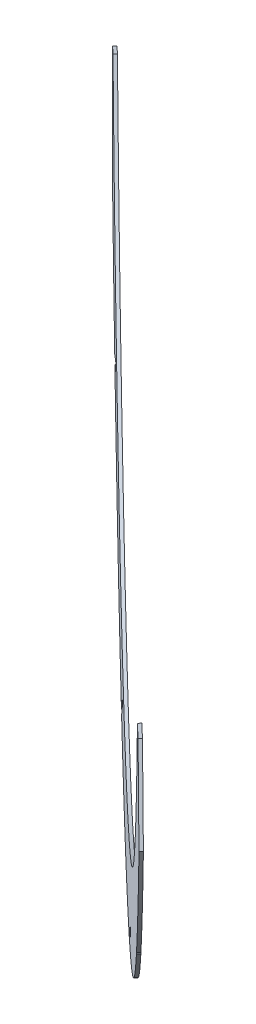
ISO-10303-21;
HEADER;
FILE_DESCRIPTION(('STEP AP214'),'2;1');
FILE_NAME('part.step','',(''),(''),'','','');
FILE_SCHEMA(('AUTOMOTIVE_DESIGN { 1 0 10303 214 1 1 1 1 }'));
ENDSEC;
DATA;
#1=APPLICATION_CONTEXT('core data for automotive mechanical design processes');
#2=APPLICATION_PROTOCOL_DEFINITION('international standard','automotive_design',2000,#1);
#3=PRODUCT_CONTEXT('',#1,'mechanical');
#4=PRODUCT('Part','Part','',(#3));
#5=PRODUCT_RELATED_PRODUCT_CATEGORY('part','',(#4));
#6=PRODUCT_DEFINITION_FORMATION('','',#4);
#7=PRODUCT_DEFINITION_CONTEXT('part definition',#1,'design');
#8=PRODUCT_DEFINITION('design','',#6,#7);
#9=PRODUCT_DEFINITION_SHAPE('','',#8);
#10=(LENGTH_UNIT() NAMED_UNIT(*) SI_UNIT(.MILLI.,.METRE.));
#11=(NAMED_UNIT(*) PLANE_ANGLE_UNIT() SI_UNIT($,.RADIAN.));
#12=(NAMED_UNIT(*) SI_UNIT($,.STERADIAN.) SOLID_ANGLE_UNIT());
#13=UNCERTAINTY_MEASURE_WITH_UNIT(LENGTH_MEASURE(1.E-05),#10,'distance_accuracy_value','');
#14=(GEOMETRIC_REPRESENTATION_CONTEXT(3) GLOBAL_UNCERTAINTY_ASSIGNED_CONTEXT((#13)) GLOBAL_UNIT_ASSIGNED_CONTEXT((#10,
#11,#12)) REPRESENTATION_CONTEXT('',''));
#15=CARTESIAN_POINT('',(0.,0.,0.));
#16=DIRECTION('',(0.,0.,1.));
#17=DIRECTION('',(1.,0.,0.));
#18=AXIS2_PLACEMENT_3D('',#15,#16,#17);
#19=CARTESIAN_POINT('',(-163.082588536067,0.,169.399508697981));
#20=DIRECTION('',(-0.693547097638021,0.,0.720411287639136));
#21=DIRECTION('',(0.720411287639136,0.,0.693547097638021));
#22=AXIS2_PLACEMENT_3D('',#19,#20,#21);
#23=PLANE('',#22);
#24=DIRECTION('',(0.,1.,0.));
#25=VECTOR('',#24,1.);
#26=CARTESIAN_POINT('',(-0.0434944065991205,-1.09376683859794E-12,326.358862993476));
#27=LINE('',#26,#25);
#28=CARTESIAN_POINT('',(-0.0434944065998229,-194.606586251928,326.358862993475));
#29=VERTEX_POINT('',#28);
#30=CARTESIAN_POINT('',(-0.04349440659967,-153.85068584765,326.358862993475));
#31=VERTEX_POINT('',#30);
#32=EDGE_CURVE('E369',#29,#31,#27,.T.);
#33=ORIENTED_EDGE('',*,*,#32,.F.);
#34=CARTESIAN_POINT('',(-163.082588536067,0.,169.399508697981));
#35=DIRECTION('',(-0.693547097638021,0.,0.720411287639136));
#36=DIRECTION('',(0.720411287639136,0.,0.693547097638021));
#37=AXIS2_PLACEMENT_3D('',#34,#35,#36);
#38=CIRCLE('',#37,298.478991770015);
#39=CARTESIAN_POINT('',(-89.8715580202318,-280.646190390097,239.880494491169));
#40=VERTEX_POINT('',#39);
#41=EDGE_CURVE('E198',#40,#29,#38,.T.);
#42=ORIENTED_EDGE('',*,*,#41,.F.);
#43=DIRECTION('',(-0.296188126760781,-0.911573321638449,-0.285143249688614));
#44=VECTOR('',#43,1.);
#45=CARTESIAN_POINT('',(-26.4730330923991,-85.5255939385082,300.914883752787));
#46=LINE('',#45,#44);
#47=CARTESIAN_POINT('',(-81.545703924022,-255.021846305269,247.895876874623));
#48=VERTEX_POINT('',#47);
#49=EDGE_CURVE('E54',#48,#40,#46,.T.);
#50=ORIENTED_EDGE('',*,*,#49,.F.);
#51=CARTESIAN_POINT('',(-82.1634388218264,-254.635108028728,247.301177356677));
#52=DIRECTION('',(-0.693547097638021,0.,0.720411287639136));
#53=DIRECTION('',(0.720411287639136,0.,0.693547097638021));
#54=AXIS2_PLACEMENT_3D('',#51,#52,#53);
#55=CIRCLE('',#54,0.940654248463412);
#56=CARTESIAN_POINT('',(-82.7811737196307,-254.248369752187,246.706477838731));
#57=VERTEX_POINT('',#56);
#58=EDGE_CURVE('E344',#57,#48,#55,.F.);
#59=ORIENTED_EDGE('',*,*,#58,.F.);
#60=DIRECTION('',(0.296188126760782,0.911573321638449,0.285143249688615));
#61=VECTOR('',#60,1.);
#62=CARTESIAN_POINT('',(-27.7085028880077,-84.7521173854275,299.725484716894));
#63=LINE('',#62,#61);
#64=CARTESIAN_POINT('',(-91.6438396297118,-281.524850719129,238.174301393501));
#65=VERTEX_POINT('',#64);
#66=EDGE_CURVE('E349',#65,#57,#63,.T.);
#67=ORIENTED_EDGE('',*,*,#66,.F.);
#68=CARTESIAN_POINT('',(-209.848262861813,-291.334377750058,124.377729813872));
#69=VERTEX_POINT('',#68);
#70=EDGE_CURVE('E390',#69,#65,#38,.T.);
#71=ORIENTED_EDGE('',*,*,#70,.F.);
#72=DIRECTION('',(0.511561649630655,0.704104205758048,0.49248547802041));
#73=VECTOR('',#72,1.);
#74=CARTESIAN_POINT('',(-81.3307482807173,-114.445194216746,248.102816806149));
#75=LINE('',#74,#73);
#76=CARTESIAN_POINT('',(-197.305171885823,-274.07029410388,136.453088003102));
#77=VERTEX_POINT('',#76);
#78=EDGE_CURVE('E302',#69,#77,#75,.T.);
#79=ORIENTED_EDGE('',*,*,#78,.T.);
#80=CARTESIAN_POINT('',(-197.922906783628,-273.205521028034,135.858388485156));
#81=DIRECTION('',(-0.693547097638021,0.,0.720411287639136));
#82=DIRECTION('',(0.720411287639136,0.,0.693547097638021));
#83=AXIS2_PLACEMENT_3D('',#80,#81,#82);
#84=CIRCLE('',#83,1.21782445094459);
#85=CARTESIAN_POINT('',(-198.540641681432,-272.340747952188,135.26368896721));
#86=VERTEX_POINT('',#85);
#87=EDGE_CURVE('E11',#77,#86,#84,.T.);
#88=ORIENTED_EDGE('',*,*,#87,.T.);
#89=DIRECTION('',(-0.511561649630653,-0.704104205758051,-0.492485478020408));
#90=VECTOR('',#89,1.);
#91=CARTESIAN_POINT('',(-82.566218076326,-112.715648065053,246.913417770257));
#92=LINE('',#91,#90);
#93=CARTESIAN_POINT('',(-211.874593581143,-290.693358275383,122.42696111638));
#94=VERTEX_POINT('',#93);
#95=EDGE_CURVE('E300',#86,#94,#92,.T.);
#96=ORIENTED_EDGE('',*,*,#95,.T.);
#97=CARTESIAN_POINT('',(-305.071672650379,-224.150566975006,32.7052079930625));
#98=VERTEX_POINT('',#97);
#99=EDGE_CURVE('E218',#98,#94,#38,.T.);
#100=ORIENTED_EDGE('',*,*,#99,.F.);
#101=DIRECTION('',(-0.638267967412966,-0.463728822589064,-0.614466907875991));
#102=VECTOR('',#101,1.);
#103=CARTESIAN_POINT('',(-127.271734922928,-94.9713507393069,203.874972941087));
#104=LINE('',#103,#102);
#105=CARTESIAN_POINT('',(-290.88812189991,-213.845614156668,46.3598530909017));
#106=VERTEX_POINT('',#105);
#107=EDGE_CURVE('E233',#106,#98,#104,.T.);
#108=ORIENTED_EDGE('',*,*,#107,.F.);
#109=CARTESIAN_POINT('',(-291.505856797714,-212.20736452774,45.7651535729555));
#110=DIRECTION('',(-0.693547097638021,0.,0.720411287639136));
#111=DIRECTION('',(0.720411287639136,0.,0.693547097638021));
#112=AXIS2_PLACEMENT_3D('',#109,#110,#111);
#113=CIRCLE('',#112,1.84908782032939);
#114=CARTESIAN_POINT('',(-292.123591695518,-210.569114898813,45.1704540550094));
#115=VERTEX_POINT('',#114);
#116=EDGE_CURVE('E39',#115,#106,#113,.F.);
#117=ORIENTED_EDGE('',*,*,#116,.F.);
#118=DIRECTION('',(0.638267967412966,0.463728822589065,0.614466907875991));
#119=VECTOR('',#118,1.);
#120=CARTESIAN_POINT('',(-128.507204718537,-91.6948514814525,202.685573905195));
#121=LINE('',#120,#119);
#122=CARTESIAN_POINT('',(-307.197550513244,-221.520987045292,30.6586042723541));
#123=VERTEX_POINT('',#122);
#124=EDGE_CURVE('E242',#123,#115,#121,.T.);
#125=ORIENTED_EDGE('',*,*,#124,.F.);
#126=CARTESIAN_POINT('',(-336.932991573868,-175.652676961867,2.03200000000001));
#127=VERTEX_POINT('',#126);
#128=EDGE_CURVE('E216',#127,#123,#38,.T.);
#129=ORIENTED_EDGE('',*,*,#128,.F.);
#130=DIRECTION('',(0.,1.,0.));
#131=VECTOR('',#130,1.);
#132=CARTESIAN_POINT('',(-336.932991573868,0.,2.03200000000001));
#133=LINE('',#132,#131);
#134=CARTESIAN_POINT('',(-336.932991573868,-109.848213355413,2.03200000000001));
#135=VERTEX_POINT('',#134);
#136=EDGE_CURVE('E245',#127,#135,#133,.T.);
#137=ORIENTED_EDGE('',*,*,#136,.T.);
#138=DIRECTION('',(-0.701450777031487,-0.227915173395434,-0.675293625868076));
#139=VECTOR('',#138,1.);
#140=CARTESIAN_POINT('',(-154.551730465137,-50.5889493973827,177.612250442832));
#141=LINE('',#140,#139);
#142=CARTESIAN_POINT('',(-331.248318602605,-108.001151140407,7.50469109727722));
#143=VERTEX_POINT('',#142);
#144=EDGE_CURVE('E266',#143,#135,#141,.T.);
#145=ORIENTED_EDGE('',*,*,#144,.F.);
#146=CARTESIAN_POINT('',(-163.082588536067,0.,169.399508697981));
#147=DIRECTION('',(-0.693547097638021,0.,0.720411287639136));
#148=DIRECTION('',(0.720411287639136,0.,0.693547097638021));
#149=AXIS2_PLACEMENT_3D('',#146,#147,#148);
#150=CIRCLE('',#149,257.203991770015);
#151=CARTESIAN_POINT('',(14.139022826077,-75.0839301911765,340.012513113476));
#152=VERTEX_POINT('',#151);
#153=EDGE_CURVE('E210',#143,#152,#150,.T.);
#154=ORIENTED_EDGE('',*,*,#153,.T.);
#155=CARTESIAN_POINT('',(1.14504625820033,0.,327.503082889305));
#156=DIRECTION('',(-0.693547097638021,0.,0.720411287639136));
#157=DIRECTION('',(-0.720411287639136,0.,-0.693547097638021));
#158=AXIS2_PLACEMENT_3D('',#155,#156,#157);
#159=ELLIPSE('',#158,105.772912373036,76.2);
#160=CARTESIAN_POINT('',(23.4987070872603,-72.8474697401313,349.023174058872));
#161=VERTEX_POINT('',#160);
#162=EDGE_CURVE('E264',#161,#152,#159,.F.);
#163=ORIENTED_EDGE('',*,*,#162,.F.);
#164=DIRECTION('',(-0.296188126760788,0.911573321638445,-0.285143249688621));
#165=VECTOR('',#164,1.);
#166=CARTESIAN_POINT('',(-27.7085028880087,84.7521173854288,299.725484716894));
#167=LINE('',#166,#165);
#168=CARTESIAN_POINT('',(36.2268338536968,-112.020615948272,361.276668040288));
#169=VERTEX_POINT('',#168);
#170=EDGE_CURVE('E335',#169,#161,#167,.T.);
#171=ORIENTED_EDGE('',*,*,#170,.F.);
#172=CARTESIAN_POINT('',(1.18854066480095,-192.599902208894,327.544955386278));
#173=VERTEX_POINT('',#172);
#174=EDGE_CURVE('E214',#173,#169,#38,.T.);
#175=ORIENTED_EDGE('',*,*,#174,.F.);
#176=DIRECTION('',(0.,-1.,0.));
#177=VECTOR('',#176,1.);
#178=CARTESIAN_POINT('',(1.18854066480165,-1.15910241086105E-12,327.544955386279));
#179=LINE('',#178,#177);
#180=CARTESIAN_POINT('',(1.1885406648011,-153.85068584765,327.544955386278));
#181=VERTEX_POINT('',#180);
#182=EDGE_CURVE('E46',#181,#173,#179,.T.);
#183=ORIENTED_EDGE('',*,*,#182,.F.);
#184=CARTESIAN_POINT('',(0.572523129100713,-153.85068584765,326.951909189877));
#185=DIRECTION('',(-0.693547097638021,0.,0.720411287639136));
#186=DIRECTION('',(0.720411287639136,0.,0.693547097638021));
#187=AXIS2_PLACEMENT_3D('',#184,#185,#186);
#188=CIRCLE('',#187,0.855091454381761);
#189=EDGE_CURVE('E363',#31,#181,#188,.F.);
#190=ORIENTED_EDGE('',*,*,#189,.F.);
#191=EDGE_LOOP('',(#33,#42,#50,#59,#67,#71,#79,#88,#96,#100,#108,#117,#125,#129,#137,#145,#154,
#163,#171,#175,#183,#190));
#192=FACE_BOUND('',#191,.T.);
#193=ADVANCED_FACE('F31',(#192),#23,.F.);
#194=CARTESIAN_POINT('',(-164.227634794267,0.,170.588907733874));
#195=DIRECTION('',(-0.693547097638021,0.,0.720411287639136));
#196=DIRECTION('',(0.720411287639136,0.,0.693547097638021));
#197=AXIS2_PLACEMENT_3D('',#194,#195,#196);
#198=PLANE('',#197);
#199=CARTESIAN_POINT('',(-164.227634794267,0.,170.588907733874));
#200=DIRECTION('',(-0.693547097638021,0.,0.720411287639136));
#201=DIRECTION('',(0.720411287639136,0.,0.693547097638021));
#202=AXIS2_PLACEMENT_3D('',#199,#200,#201);
#203=CIRCLE('',#202,298.478991770015);
#204=CARTESIAN_POINT('',(-91.0166042784322,-280.646190390097,241.069893527061));
#205=VERTEX_POINT('',#204);
#206=CARTESIAN_POINT('',(-1.1885406648002,-194.606586251928,327.548262029367));
#207=VERTEX_POINT('',#206);
#208=EDGE_CURVE('E196',#205,#207,#203,.T.);
#209=ORIENTED_EDGE('',*,*,#208,.T.);
#210=DIRECTION('',(0.,-1.,0.));
#211=VECTOR('',#210,1.);
#212=CARTESIAN_POINT('',(-1.1885406648002,-194.606586251928,327.548262029367));
#213=LINE('',#212,#211);
#214=CARTESIAN_POINT('',(-1.18854066480004,-153.85068584765,327.548262029367));
#215=VERTEX_POINT('',#214);
#216=EDGE_CURVE('E180',#215,#207,#213,.T.);
#217=ORIENTED_EDGE('',*,*,#216,.F.);
#218=CARTESIAN_POINT('',(-0.572523129099639,-153.85068584765,328.141308225769));
#219=DIRECTION('',(-0.693547097638021,0.,0.720411287639136));
#220=DIRECTION('',(-0.720411287639136,0.,-0.693547097638021));
#221=AXIS2_PLACEMENT_3D('',#218,#219,#220);
#222=CIRCLE('',#221,0.855091454381761);
#223=CARTESIAN_POINT('',(0.0434944066007471,-153.85068584765,328.734354422171));
#224=VERTEX_POINT('',#223);
#225=EDGE_CURVE('E373',#224,#215,#222,.T.);
#226=ORIENTED_EDGE('',*,*,#225,.F.);
#227=DIRECTION('',(0.,1.,0.));
#228=VECTOR('',#227,1.);
#229=CARTESIAN_POINT('',(0.0434944066005638,-192.599902208894,328.73435442217));
#230=LINE('',#229,#228);
#231=CARTESIAN_POINT('',(0.0434944066005638,-192.599902208894,328.73435442217));
#232=VERTEX_POINT('',#231);
#233=EDGE_CURVE('E376',#232,#224,#230,.T.);
#234=ORIENTED_EDGE('',*,*,#233,.F.);
#235=CARTESIAN_POINT('',(35.0817875954965,-112.020615948272,362.466067076181));
#236=VERTEX_POINT('',#235);
#237=EDGE_CURVE('E206',#232,#236,#203,.T.);
#238=ORIENTED_EDGE('',*,*,#237,.T.);
#239=DIRECTION('',(0.296188126760789,-0.911573321638445,0.28514324968862));
#240=VECTOR('',#239,1.);
#241=CARTESIAN_POINT('',(22.35366082906,-72.8474697401314,350.212573094764));
#242=LINE('',#241,#240);
#243=CARTESIAN_POINT('',(22.35366082906,-72.8474697401314,350.212573094764));
#244=VERTEX_POINT('',#243);
#245=EDGE_CURVE('E340',#244,#236,#242,.T.);
#246=ORIENTED_EDGE('',*,*,#245,.F.);
#247=CARTESIAN_POINT('',(0.,0.,328.692481925197));
#248=DIRECTION('',(-0.693547097638021,0.,0.720411287639136));
#249=DIRECTION('',(-0.720411287639136,0.,-0.693547097638021));
#250=AXIS2_PLACEMENT_3D('',#247,#248,#249);
#251=ELLIPSE('',#250,105.772912373035,76.2);
#252=CARTESIAN_POINT('',(12.9939765678766,-75.0839301911766,341.201912149368));
#253=VERTEX_POINT('',#252);
#254=EDGE_CURVE('E253',#244,#253,#251,.F.);
#255=ORIENTED_EDGE('',*,*,#254,.T.);
#256=CARTESIAN_POINT('',(-164.227634794267,0.,170.588907733874));
#257=DIRECTION('',(-0.693547097638021,0.,0.720411287639136));
#258=DIRECTION('',(0.720411287639136,0.,0.693547097638021));
#259=AXIS2_PLACEMENT_3D('',#256,#257,#258);
#260=CIRCLE('',#259,257.203991770015);
#261=CARTESIAN_POINT('',(-332.393364860806,-108.001151140407,8.69409013316946));
#262=VERTEX_POINT('',#261);
#263=EDGE_CURVE('E254',#262,#253,#260,.T.);
#264=ORIENTED_EDGE('',*,*,#263,.F.);
#265=DIRECTION('',(0.701450777031484,0.227915173395434,0.675293625868078));
#266=VECTOR('',#265,1.);
#267=CARTESIAN_POINT('',(-338.078037832069,-109.848213355413,3.22139903589216));
#268=LINE('',#267,#266);
#269=CARTESIAN_POINT('',(-338.078037832069,-109.848213355413,3.22139903589216));
#270=VERTEX_POINT('',#269);
#271=EDGE_CURVE('E330',#270,#262,#268,.T.);
#272=ORIENTED_EDGE('',*,*,#271,.F.);
#273=DIRECTION('',(0.,1.,0.));
#274=VECTOR('',#273,1.);
#275=CARTESIAN_POINT('',(-338.078037832069,0.,3.22139903589219));
#276=LINE('',#275,#274);
#277=CARTESIAN_POINT('',(-338.078037832069,-175.652676961867,3.2213990358922));
#278=VERTEX_POINT('',#277);
#279=EDGE_CURVE('E281',#278,#270,#276,.T.);
#280=ORIENTED_EDGE('',*,*,#279,.F.);
#281=CARTESIAN_POINT('',(-308.342596771444,-221.520987045292,31.8480033082462));
#282=VERTEX_POINT('',#281);
#283=EDGE_CURVE('E211',#278,#282,#203,.T.);
#284=ORIENTED_EDGE('',*,*,#283,.T.);
#285=DIRECTION('',(-0.638267967412965,-0.463728822589065,-0.614466907875991));
#286=VECTOR('',#285,1.);
#287=CARTESIAN_POINT('',(-293.268637953719,-210.569114898813,46.3598530909016));
#288=LINE('',#287,#286);
#289=CARTESIAN_POINT('',(-293.268637953719,-210.569114898813,46.3598530909016));
#290=VERTEX_POINT('',#289);
#291=EDGE_CURVE('E247',#290,#282,#288,.T.);
#292=ORIENTED_EDGE('',*,*,#291,.F.);
#293=CARTESIAN_POINT('',(-292.650903055914,-212.20736452774,46.9545526088477));
#294=DIRECTION('',(-0.693547097638021,0.,0.720411287639136));
#295=DIRECTION('',(-0.720411287639136,0.,-0.693547097638021));
#296=AXIS2_PLACEMENT_3D('',#293,#294,#295);
#297=CIRCLE('',#296,1.84908782032939);
#298=CARTESIAN_POINT('',(-292.03316815811,-213.845614156668,47.5492521267938));
#299=VERTEX_POINT('',#298);
#300=EDGE_CURVE('E238',#299,#290,#297,.T.);
#301=ORIENTED_EDGE('',*,*,#300,.F.);
#302=DIRECTION('',(0.638267967412966,0.463728822589064,0.61446690787599));
#303=VECTOR('',#302,1.);
#304=CARTESIAN_POINT('',(-306.216718908579,-224.150566975006,33.8946070289546));
#305=LINE('',#304,#303);
#306=CARTESIAN_POINT('',(-306.216718908579,-224.150566975006,33.8946070289546));
#307=VERTEX_POINT('',#306);
#308=EDGE_CURVE('E236',#307,#299,#305,.T.);
#309=ORIENTED_EDGE('',*,*,#308,.F.);
#310=CARTESIAN_POINT('',(-213.019639839343,-290.693358275383,123.616360152272));
#311=VERTEX_POINT('',#310);
#312=EDGE_CURVE('E209',#307,#311,#203,.T.);
#313=ORIENTED_EDGE('',*,*,#312,.T.);
#314=DIRECTION('',(0.511561649630653,0.704104205758051,0.492485478020408));
#315=VECTOR('',#314,1.);
#316=CARTESIAN_POINT('',(-213.019639839343,-290.693358275383,123.616360152272));
#317=LINE('',#316,#315);
#318=CARTESIAN_POINT('',(-199.685687939632,-272.340747952188,136.453088003102));
#319=VERTEX_POINT('',#318);
#320=EDGE_CURVE('E288',#311,#319,#317,.T.);
#321=ORIENTED_EDGE('',*,*,#320,.T.);
#322=CARTESIAN_POINT('',(-199.067953041828,-273.205521028034,137.047787521048));
#323=DIRECTION('',(0.693547097638021,0.,-0.720411287639136));
#324=DIRECTION('',(-0.720411287639136,0.,-0.693547097638021));
#325=AXIS2_PLACEMENT_3D('',#322,#323,#324);
#326=CIRCLE('',#325,1.21782445094459);
#327=CARTESIAN_POINT('',(-198.450218144024,-274.07029410388,137.642487038994));
#328=VERTEX_POINT('',#327);
#329=EDGE_CURVE('E284',#319,#328,#326,.T.);
#330=ORIENTED_EDGE('',*,*,#329,.T.);
#331=DIRECTION('',(-0.511561649630654,-0.704104205758048,-0.49248547802041));
#332=VECTOR('',#331,1.);
#333=CARTESIAN_POINT('',(-210.993309120013,-291.334377750058,125.567128849764));
#334=LINE('',#333,#332);
#335=CARTESIAN_POINT('',(-210.993309120013,-291.334377750058,125.567128849764));
#336=VERTEX_POINT('',#335);
#337=EDGE_CURVE('E290',#328,#336,#334,.T.);
#338=ORIENTED_EDGE('',*,*,#337,.T.);
#339=CARTESIAN_POINT('',(-92.7888858879122,-281.524850719129,239.363700429393));
#340=VERTEX_POINT('',#339);
#341=EDGE_CURVE('E205',#336,#340,#203,.T.);
#342=ORIENTED_EDGE('',*,*,#341,.T.);
#343=DIRECTION('',(-0.296188126760783,-0.911573321638449,-0.285143249688615));
#344=VECTOR('',#343,1.);
#345=CARTESIAN_POINT('',(-92.7888858879122,-281.524850719129,239.363700429393));
#346=LINE('',#345,#344);
#347=CARTESIAN_POINT('',(-83.9262199778311,-254.248369752187,247.895876874623));
#348=VERTEX_POINT('',#347);
#349=EDGE_CURVE('E354',#348,#340,#346,.T.);
#350=ORIENTED_EDGE('',*,*,#349,.F.);
#351=CARTESIAN_POINT('',(-83.3084850800267,-254.635108028728,248.490576392569));
#352=DIRECTION('',(-0.693547097638021,0.,0.720411287639136));
#353=DIRECTION('',(-0.720411287639136,0.,-0.693547097638021));
#354=AXIS2_PLACEMENT_3D('',#351,#352,#353);
#355=CIRCLE('',#354,0.940654248463412);
#356=CARTESIAN_POINT('',(-82.6907501822224,-255.021846305269,249.085275910515));
#357=VERTEX_POINT('',#356);
#358=EDGE_CURVE('E358',#357,#348,#355,.T.);
#359=ORIENTED_EDGE('',*,*,#358,.F.);
#360=DIRECTION('',(0.296188126760781,0.91157332163845,0.285143249688614));
#361=VECTOR('',#360,1.);
#362=CARTESIAN_POINT('',(-91.0166042784322,-280.646190390097,241.069893527061));
#363=LINE('',#362,#361);
#364=EDGE_CURVE('E204',#205,#357,#363,.T.);
#365=ORIENTED_EDGE('',*,*,#364,.F.);
#366=EDGE_LOOP('',(#209,#217,#226,#234,#238,#246,#255,#264,#272,#280,#284,#292,#301,#309,#313,
#321,#330,#338,#342,#350,#359,#365));
#367=FACE_BOUND('',#366,.T.);
#368=ADVANCED_FACE('F201',(#367),#198,.T.);
#369=CARTESIAN_POINT('',(-163.082588536067,0.,169.399508697981));
#370=DIRECTION('',(-0.693547097638021,0.,0.720411287639136));
#371=DIRECTION('',(0.720411287639136,0.,0.693547097638021));
#372=AXIS2_PLACEMENT_3D('',#369,#370,#371);
#373=CYLINDRICAL_SURFACE('',#372,298.478991770015);
#374=ORIENTED_EDGE('',*,*,#41,.T.);
#375=DIRECTION('',(0.693547097638021,0.,-0.720411287639136));
#376=VECTOR('',#375,1.);
#377=CARTESIAN_POINT('',(-1.1885406648002,-194.606586251928,327.548262029367));
#378=LINE('',#377,#376);
#379=EDGE_CURVE('E183',#207,#29,#378,.T.);
#380=ORIENTED_EDGE('',*,*,#379,.F.);
#381=ORIENTED_EDGE('',*,*,#208,.F.);
#382=DIRECTION('',(0.693547097638021,0.,-0.720411287639136));
#383=VECTOR('',#382,1.);
#384=CARTESIAN_POINT('',(-91.0166042784322,-280.646190390097,241.069893527061));
#385=LINE('',#384,#383);
#386=EDGE_CURVE('E361',#205,#40,#385,.T.);
#387=ORIENTED_EDGE('',*,*,#386,.T.);
#388=EDGE_LOOP('',(#374,#380,#381,#387));
#389=FACE_BOUND('',#388,.T.);
#390=ADVANCED_FACE('F195',(#389),#373,.T.);
#391=ORIENTED_EDGE('',*,*,#237,.F.);
#392=DIRECTION('',(0.693547097638021,0.,-0.720411287639136));
#393=VECTOR('',#392,1.);
#394=CARTESIAN_POINT('',(0.0434944066005638,-192.599902208894,328.73435442217));
#395=LINE('',#394,#393);
#396=EDGE_CURVE('E377',#232,#173,#395,.T.);
#397=ORIENTED_EDGE('',*,*,#396,.T.);
#398=ORIENTED_EDGE('',*,*,#174,.T.);
#399=DIRECTION('',(0.693547097638021,0.,-0.720411287639136));
#400=VECTOR('',#399,1.);
#401=CARTESIAN_POINT('',(35.0817875954965,-112.020615948272,362.466067076181));
#402=LINE('',#401,#400);
#403=EDGE_CURVE('E336',#236,#169,#402,.T.);
#404=ORIENTED_EDGE('',*,*,#403,.F.);
#405=EDGE_LOOP('',(#391,#397,#398,#404));
#406=FACE_BOUND('',#405,.T.);
#407=ADVANCED_FACE('F474',(#406),#373,.T.);
#408=ORIENTED_EDGE('',*,*,#70,.T.);
#409=DIRECTION('',(0.693547097638021,0.,-0.720411287639136));
#410=VECTOR('',#409,1.);
#411=CARTESIAN_POINT('',(-92.7888858879122,-281.524850719129,239.363700429393));
#412=LINE('',#411,#410);
#413=EDGE_CURVE('E352',#340,#65,#412,.T.);
#414=ORIENTED_EDGE('',*,*,#413,.F.);
#415=ORIENTED_EDGE('',*,*,#341,.F.);
#416=DIRECTION('',(0.693547097638021,0.,-0.720411287639136));
#417=VECTOR('',#416,1.);
#418=CARTESIAN_POINT('',(-210.993309120013,-291.334377750058,125.567128849764));
#419=LINE('',#418,#417);
#420=EDGE_CURVE('E292',#336,#69,#419,.T.);
#421=ORIENTED_EDGE('',*,*,#420,.T.);
#422=EDGE_LOOP('',(#408,#414,#415,#421));
#423=FACE_BOUND('',#422,.T.);
#424=ADVANCED_FACE('F395',(#423),#373,.T.);
#425=CARTESIAN_POINT('',(0.,0.,328.692481925197));
#426=DIRECTION('',(-0.693547097638021,0.,0.720411287639136));
#427=DIRECTION('',(-0.720411287639136,0.,-0.693547097638021));
#428=AXIS2_PLACEMENT_3D('',#425,#426,#427);
#429=ELLIPSE('',#428,105.772912373036,76.2);
#430=DIRECTION('',(0.693547097638021,0.,-0.720411287639136));
#431=VECTOR('',#430,1.);
#432=SURFACE_OF_LINEAR_EXTRUSION('',#429,#431);
#433=ORIENTED_EDGE('',*,*,#254,.F.);
#434=DIRECTION('',(0.693547097638021,0.,-0.720411287639136));
#435=VECTOR('',#434,1.);
#436=CARTESIAN_POINT('',(22.35366082906,-72.8474697401314,350.212573094764));
#437=LINE('',#436,#435);
#438=EDGE_CURVE('E343',#244,#161,#437,.T.);
#439=ORIENTED_EDGE('',*,*,#438,.T.);
#440=ORIENTED_EDGE('',*,*,#162,.T.);
#441=DIRECTION('',(0.693547097638021,0.,-0.720411287639136));
#442=VECTOR('',#441,1.);
#443=CARTESIAN_POINT('',(12.9939765678766,-75.0839301911766,341.201912149368));
#444=LINE('',#443,#442);
#445=EDGE_CURVE('E268',#253,#152,#444,.T.);
#446=ORIENTED_EDGE('',*,*,#445,.F.);
#447=EDGE_LOOP('',(#433,#439,#440,#446));
#448=FACE_BOUND('',#447,.T.);
#449=ADVANCED_FACE('F438',(#448),#432,.T.);
#450=CARTESIAN_POINT('',(-163.082588536067,0.,169.399508697981));
#451=DIRECTION('',(-0.693547097638021,0.,0.720411287639136));
#452=DIRECTION('',(0.720411287639136,0.,0.693547097638021));
#453=AXIS2_PLACEMENT_3D('',#450,#451,#452);
#454=CYLINDRICAL_SURFACE('',#453,257.203991770015);
#455=DIRECTION('',(0.693547097638021,0.,-0.720411287639136));
#456=VECTOR('',#455,1.);
#457=CARTESIAN_POINT('',(-332.393364860806,-108.001151140407,8.69409013316938));
#458=LINE('',#457,#456);
#459=EDGE_CURVE('E275',#262,#143,#458,.T.);
#460=ORIENTED_EDGE('',*,*,#459,.F.);
#461=ORIENTED_EDGE('',*,*,#263,.T.);
#462=ORIENTED_EDGE('',*,*,#445,.T.);
#463=ORIENTED_EDGE('',*,*,#153,.F.);
#464=EDGE_LOOP('',(#460,#461,#462,#463));
#465=FACE_BOUND('',#464,.T.);
#466=ADVANCED_FACE('F269',(#465),#454,.F.);
#467=CARTESIAN_POINT('',(-336.932991573868,-175.652676961867,2.03200000000001));
#468=DIRECTION('',(0.720411287639136,0.,0.693547097638021));
#469=DIRECTION('',(0.693547097638021,0.,-0.720411287639136));
#470=AXIS2_PLACEMENT_3D('',#467,#468,#469);
#471=PLANE('',#470);
#472=DIRECTION('',(0.693547097638021,0.,-0.720411287639136));
#473=VECTOR('',#472,1.);
#474=CARTESIAN_POINT('',(-338.078037832069,-109.848213355413,3.22139903589216));
#475=LINE('',#474,#473);
#476=EDGE_CURVE('E328',#270,#135,#475,.T.);
#477=ORIENTED_EDGE('',*,*,#476,.T.);
#478=ORIENTED_EDGE('',*,*,#136,.F.);
#479=DIRECTION('',(-0.693547097638021,0.,0.720411287639136));
#480=VECTOR('',#479,1.);
#481=CARTESIAN_POINT('',(-336.932991573868,-175.652676961867,2.03200000000001));
#482=LINE('',#481,#480);
#483=EDGE_CURVE('E273',#127,#278,#482,.T.);
#484=ORIENTED_EDGE('',*,*,#483,.T.);
#485=ORIENTED_EDGE('',*,*,#279,.T.);
#486=EDGE_LOOP('',(#477,#478,#484,#485));
#487=FACE_BOUND('',#486,.T.);
#488=ADVANCED_FACE('F437',(#487),#471,.F.);
#489=ORIENTED_EDGE('',*,*,#483,.F.);
#490=ORIENTED_EDGE('',*,*,#128,.T.);
#491=DIRECTION('',(0.693547097638021,0.,-0.720411287639136));
#492=VECTOR('',#491,1.);
#493=CARTESIAN_POINT('',(-308.342596771444,-221.520987045292,31.8480033082462));
#494=LINE('',#493,#492);
#495=EDGE_CURVE('E243',#282,#123,#494,.T.);
#496=ORIENTED_EDGE('',*,*,#495,.F.);
#497=ORIENTED_EDGE('',*,*,#283,.F.);
#498=EDGE_LOOP('',(#489,#490,#496,#497));
#499=FACE_BOUND('',#498,.T.);
#500=ADVANCED_FACE('F33',(#499),#373,.T.);
#501=DIRECTION('',(0.693547097638021,0.,-0.720411287639136));
#502=VECTOR('',#501,1.);
#503=CARTESIAN_POINT('',(-213.019639839343,-290.693358275383,123.616360152272));
#504=LINE('',#503,#502);
#505=EDGE_CURVE('E283',#311,#94,#504,.T.);
#506=ORIENTED_EDGE('',*,*,#505,.F.);
#507=ORIENTED_EDGE('',*,*,#312,.F.);
#508=DIRECTION('',(0.693547097638021,0.,-0.720411287639136));
#509=VECTOR('',#508,1.);
#510=CARTESIAN_POINT('',(-306.216718908579,-224.150566975006,33.8946070289546));
#511=LINE('',#510,#509);
#512=EDGE_CURVE('E304',#307,#98,#511,.T.);
#513=ORIENTED_EDGE('',*,*,#512,.T.);
#514=ORIENTED_EDGE('',*,*,#99,.T.);
#515=EDGE_LOOP('',(#506,#507,#513,#514));
#516=FACE_BOUND('',#515,.T.);
#517=ADVANCED_FACE('F311',(#516),#373,.T.);
#518=CARTESIAN_POINT('',(-292.650903055914,-212.20736452774,46.9545526088477));
#519=DIRECTION('',(0.693547097638021,0.,-0.720411287639136));
#520=DIRECTION('',(-0.720411287639136,0.,-0.693547097638021));
#521=AXIS2_PLACEMENT_3D('',#518,#519,#520);
#522=CYLINDRICAL_SURFACE('',#521,1.84908782032939);
#523=DIRECTION('',(0.693547097638021,0.,-0.720411287639136));
#524=VECTOR('',#523,1.);
#525=CARTESIAN_POINT('',(-293.268637953719,-210.569114898813,46.3598530909016));
#526=LINE('',#525,#524);
#527=EDGE_CURVE('E227',#290,#115,#526,.T.);
#528=ORIENTED_EDGE('',*,*,#527,.T.);
#529=ORIENTED_EDGE('',*,*,#116,.T.);
#530=DIRECTION('',(0.693547097638021,0.,-0.720411287639136));
#531=VECTOR('',#530,1.);
#532=CARTESIAN_POINT('',(-292.03316815811,-213.845614156668,47.5492521267938));
#533=LINE('',#532,#531);
#534=EDGE_CURVE('E225',#299,#106,#533,.T.);
#535=ORIENTED_EDGE('',*,*,#534,.F.);
#536=ORIENTED_EDGE('',*,*,#300,.T.);
#537=EDGE_LOOP('',(#528,#529,#535,#536));
#538=FACE_BOUND('',#537,.T.);
#539=ADVANCED_FACE('F223',(#538),#522,.F.);
#540=CARTESIAN_POINT('',(-293.268637953719,-210.569114898813,46.3598530909016));
#541=DIRECTION('',(0.334075478196768,-0.885977188814791,0.321617778997742));
#542=DIRECTION('',(0.935690834506645,0.352821005922633,0.));
#543=AXIS2_PLACEMENT_3D('',#540,#541,#542);
#544=PLANE('',#543);
#545=ORIENTED_EDGE('',*,*,#495,.T.);
#546=ORIENTED_EDGE('',*,*,#124,.T.);
#547=ORIENTED_EDGE('',*,*,#527,.F.);
#548=ORIENTED_EDGE('',*,*,#291,.T.);
#549=EDGE_LOOP('',(#545,#546,#547,#548));
#550=FACE_BOUND('',#549,.T.);
#551=ADVANCED_FACE('F319',(#550),#544,.T.);
#552=CARTESIAN_POINT('',(-306.216718908579,-224.150566975006,33.8946070289546));
#553=DIRECTION('',(-0.334075478196768,0.885977188814791,-0.321617778997742));
#554=DIRECTION('',(-0.935690834506645,-0.352821005922632,0.));
#555=AXIS2_PLACEMENT_3D('',#552,#553,#554);
#556=PLANE('',#555);
#557=ORIENTED_EDGE('',*,*,#534,.T.);
#558=ORIENTED_EDGE('',*,*,#107,.T.);
#559=ORIENTED_EDGE('',*,*,#512,.F.);
#560=ORIENTED_EDGE('',*,*,#308,.T.);
#561=EDGE_LOOP('',(#557,#558,#559,#560));
#562=FACE_BOUND('',#561,.T.);
#563=ADVANCED_FACE('F232',(#562),#556,.T.);
#564=CARTESIAN_POINT('',(-199.067953041828,-273.205521028034,137.047787521048));
#565=DIRECTION('',(0.693547097638021,0.,-0.720411287639136));
#566=DIRECTION('',(-0.720411287639136,0.,-0.693547097638021));
#567=AXIS2_PLACEMENT_3D('',#564,#565,#566);
#568=CYLINDRICAL_SURFACE('',#567,1.21782445094459);
#569=ORIENTED_EDGE('',*,*,#87,.F.);
#570=DIRECTION('',(0.693547097638021,0.,-0.720411287639136));
#571=VECTOR('',#570,1.);
#572=CARTESIAN_POINT('',(-198.450218144024,-274.07029410388,137.642487038994));
#573=LINE('',#572,#571);
#574=EDGE_CURVE('E286',#328,#77,#573,.T.);
#575=ORIENTED_EDGE('',*,*,#574,.F.);
#576=ORIENTED_EDGE('',*,*,#329,.F.);
#577=DIRECTION('',(0.693547097638021,0.,-0.720411287639136));
#578=VECTOR('',#577,1.);
#579=CARTESIAN_POINT('',(-199.685687939632,-272.340747952188,136.453088003102));
#580=LINE('',#579,#578);
#581=EDGE_CURVE('E287',#319,#86,#580,.T.);
#582=ORIENTED_EDGE('',*,*,#581,.T.);
#583=EDGE_LOOP('',(#569,#575,#576,#582));
#584=FACE_BOUND('',#583,.T.);
#585=ADVANCED_FACE('F408',(#584),#568,.F.);
#586=CARTESIAN_POINT('',(-210.993309120013,-291.334377750058,125.567128849764));
#587=DIRECTION('',(0.507244617502287,-0.710096660627149,0.488329428338218));
#588=DIRECTION('',(0.813715738499667,0.581263018708348,0.));
#589=AXIS2_PLACEMENT_3D('',#586,#587,#588);
#590=PLANE('',#589);
#591=ORIENTED_EDGE('',*,*,#78,.F.);
#592=ORIENTED_EDGE('',*,*,#420,.F.);
#593=ORIENTED_EDGE('',*,*,#337,.F.);
#594=ORIENTED_EDGE('',*,*,#574,.T.);
#595=EDGE_LOOP('',(#591,#592,#593,#594));
#596=FACE_BOUND('',#595,.T.);
#597=ADVANCED_FACE('F403',(#596),#590,.F.);
#598=CARTESIAN_POINT('',(-213.019639839343,-290.693358275383,123.616360152272));
#599=DIRECTION('',(-0.507244617502289,0.710096660627146,-0.48832942833822));
#600=DIRECTION('',(-0.813715738499665,-0.581263018708351,0.));
#601=AXIS2_PLACEMENT_3D('',#598,#599,#600);
#602=PLANE('',#601);
#603=ORIENTED_EDGE('',*,*,#95,.F.);
#604=ORIENTED_EDGE('',*,*,#581,.F.);
#605=ORIENTED_EDGE('',*,*,#320,.F.);
#606=ORIENTED_EDGE('',*,*,#505,.T.);
#607=EDGE_LOOP('',(#603,#604,#605,#606));
#608=FACE_BOUND('',#607,.T.);
#609=ADVANCED_FACE('F412',(#608),#602,.F.);
#610=CARTESIAN_POINT('',(-338.078037832069,-109.848213355413,3.22139903589216));
#611=DIRECTION('',(-0.164192663538302,0.973680991770985,-0.15806990701607));
#612=DIRECTION('',(-0.986078040132563,-0.166283188471728,0.));
#613=AXIS2_PLACEMENT_3D('',#610,#611,#612);
#614=PLANE('',#613);
#615=ORIENTED_EDGE('',*,*,#459,.T.);
#616=ORIENTED_EDGE('',*,*,#144,.T.);
#617=ORIENTED_EDGE('',*,*,#476,.F.);
#618=ORIENTED_EDGE('',*,*,#271,.T.);
#619=EDGE_LOOP('',(#615,#616,#617,#618));
#620=FACE_BOUND('',#619,.T.);
#621=ADVANCED_FACE('F326',(#620),#614,.T.);
#622=CARTESIAN_POINT('',(22.35366082906,-72.8474697401314,350.212573094764));
#623=DIRECTION('',(0.656707710419037,0.411137543015779,0.632219031506593));
#624=DIRECTION('',(0.693547097638021,0.,-0.720411287639136));
#625=AXIS2_PLACEMENT_3D('',#622,#623,#624);
#626=PLANE('',#625);
#627=ORIENTED_EDGE('',*,*,#403,.T.);
#628=ORIENTED_EDGE('',*,*,#170,.T.);
#629=ORIENTED_EDGE('',*,*,#438,.F.);
#630=ORIENTED_EDGE('',*,*,#245,.T.);
#631=EDGE_LOOP('',(#627,#628,#629,#630));
#632=FACE_BOUND('',#631,.T.);
#633=ADVANCED_FACE('F457',(#632),#626,.T.);
#634=CARTESIAN_POINT('',(-83.3084850800267,-254.635108028728,248.490576392569));
#635=DIRECTION('',(0.693547097638021,0.,-0.720411287639136));
#636=DIRECTION('',(-0.720411287639136,0.,-0.693547097638021));
#637=AXIS2_PLACEMENT_3D('',#634,#635,#636);
#638=CYLINDRICAL_SURFACE('',#637,0.940654248463412);
#639=DIRECTION('',(0.693547097638021,0.,-0.720411287639136));
#640=VECTOR('',#639,1.);
#641=CARTESIAN_POINT('',(-83.9262199778311,-254.248369752187,247.895876874623));
#642=LINE('',#641,#640);
#643=EDGE_CURVE('E355',#348,#57,#642,.T.);
#644=ORIENTED_EDGE('',*,*,#643,.T.);
#645=ORIENTED_EDGE('',*,*,#58,.T.);
#646=DIRECTION('',(0.693547097638021,0.,-0.720411287639136));
#647=VECTOR('',#646,1.);
#648=CARTESIAN_POINT('',(-82.6907501822224,-255.021846305269,249.085275910515));
#649=LINE('',#648,#647);
#650=EDGE_CURVE('E359',#357,#48,#649,.T.);
#651=ORIENTED_EDGE('',*,*,#650,.F.);
#652=ORIENTED_EDGE('',*,*,#358,.T.);
#653=EDGE_LOOP('',(#644,#645,#651,#652));
#654=FACE_BOUND('',#653,.T.);
#655=ADVANCED_FACE('F417',(#654),#638,.F.);
#656=CARTESIAN_POINT('',(-92.7888858879122,-281.524850719129,239.363700429393));
#657=DIRECTION('',(0.656707710419039,-0.411137543015771,0.632219031506596));
#658=DIRECTION('',(0.693547097638021,0.,-0.720411287639136));
#659=AXIS2_PLACEMENT_3D('',#656,#657,#658);
#660=PLANE('',#659);
#661=ORIENTED_EDGE('',*,*,#413,.T.);
#662=ORIENTED_EDGE('',*,*,#66,.T.);
#663=ORIENTED_EDGE('',*,*,#643,.F.);
#664=ORIENTED_EDGE('',*,*,#349,.T.);
#665=EDGE_LOOP('',(#661,#662,#663,#664));
#666=FACE_BOUND('',#665,.T.);
#667=ADVANCED_FACE('F415',(#666),#660,.T.);
#668=CARTESIAN_POINT('',(-91.0166042784322,-280.646190390097,241.069893527061));
#669=DIRECTION('',(-0.65670771041904,0.41113754301577,-0.632219031506596));
#670=DIRECTION('',(-0.693547097638021,0.,0.720411287639136));
#671=AXIS2_PLACEMENT_3D('',#668,#669,#670);
#672=PLANE('',#671);
#673=ORIENTED_EDGE('',*,*,#650,.T.);
#674=ORIENTED_EDGE('',*,*,#49,.T.);
#675=ORIENTED_EDGE('',*,*,#386,.F.);
#676=ORIENTED_EDGE('',*,*,#364,.T.);
#677=EDGE_LOOP('',(#673,#674,#675,#676));
#678=FACE_BOUND('',#677,.T.);
#679=ADVANCED_FACE('F418',(#678),#672,.T.);
#680=CARTESIAN_POINT('',(-0.572523129099639,-153.85068584765,328.141308225769));
#681=DIRECTION('',(0.693547097638021,0.,-0.720411287639136));
#682=DIRECTION('',(-0.720411287639136,0.,-0.693547097638021));
#683=AXIS2_PLACEMENT_3D('',#680,#681,#682);
#684=CYLINDRICAL_SURFACE('',#683,0.855091454381761);
#685=DIRECTION('',(0.693547097638021,0.,-0.720411287639136));
#686=VECTOR('',#685,1.);
#687=CARTESIAN_POINT('',(-1.18854066480004,-153.85068584765,327.548262029367));
#688=LINE('',#687,#686);
#689=EDGE_CURVE('E186',#215,#31,#688,.T.);
#690=ORIENTED_EDGE('',*,*,#689,.T.);
#691=ORIENTED_EDGE('',*,*,#189,.T.);
#692=DIRECTION('',(0.693547097638021,0.,-0.720411287639136));
#693=VECTOR('',#692,1.);
#694=CARTESIAN_POINT('',(0.0434944066007471,-153.85068584765,328.734354422171));
#695=LINE('',#694,#693);
#696=EDGE_CURVE('E374',#224,#181,#695,.T.);
#697=ORIENTED_EDGE('',*,*,#696,.F.);
#698=ORIENTED_EDGE('',*,*,#225,.T.);
#699=EDGE_LOOP('',(#690,#691,#697,#698));
#700=FACE_BOUND('',#699,.T.);
#701=ADVANCED_FACE('F385',(#700),#684,.F.);
#702=CARTESIAN_POINT('',(-1.1885406648002,-194.606586251928,327.548262029367));
#703=DIRECTION('',(0.720411287639136,0.,0.693547097638021));
#704=DIRECTION('',(0.693547097638021,0.,-0.720411287639136));
#705=AXIS2_PLACEMENT_3D('',#702,#703,#704);
#706=PLANE('',#705);
#707=ORIENTED_EDGE('',*,*,#379,.T.);
#708=ORIENTED_EDGE('',*,*,#32,.T.);
#709=ORIENTED_EDGE('',*,*,#689,.F.);
#710=ORIENTED_EDGE('',*,*,#216,.T.);
#711=EDGE_LOOP('',(#707,#708,#709,#710));
#712=FACE_BOUND('',#711,.T.);
#713=ADVANCED_FACE('F182',(#712),#706,.T.);
#714=CARTESIAN_POINT('',(0.0434944066005638,-192.599902208894,328.73435442217));
#715=DIRECTION('',(-0.720411287639136,0.,-0.693547097638021));
#716=DIRECTION('',(-0.693547097638021,0.,0.720411287639136));
#717=AXIS2_PLACEMENT_3D('',#714,#715,#716);
#718=PLANE('',#717);
#719=ORIENTED_EDGE('',*,*,#696,.T.);
#720=ORIENTED_EDGE('',*,*,#182,.T.);
#721=ORIENTED_EDGE('',*,*,#396,.F.);
#722=ORIENTED_EDGE('',*,*,#233,.T.);
#723=EDGE_LOOP('',(#719,#720,#721,#722));
#724=FACE_BOUND('',#723,.T.);
#725=ADVANCED_FACE('F382',(#724),#718,.T.);
#726=CLOSED_SHELL('',(#193,#368,#390,#407,#424,#449,#466,#488,#500,#517,#539,#551,#563,#585,
#597,#609,#621,#633,#655,#667,#679,#701,#713,#725));
#727=MANIFOLD_SOLID_BREP('B2',#726);
#728=ADVANCED_BREP_SHAPE_REPRESENTATION('',(#18,#727),#14);
#729=SHAPE_DEFINITION_REPRESENTATION(#9,#728);
ENDSEC;
END-ISO-10303-21;
